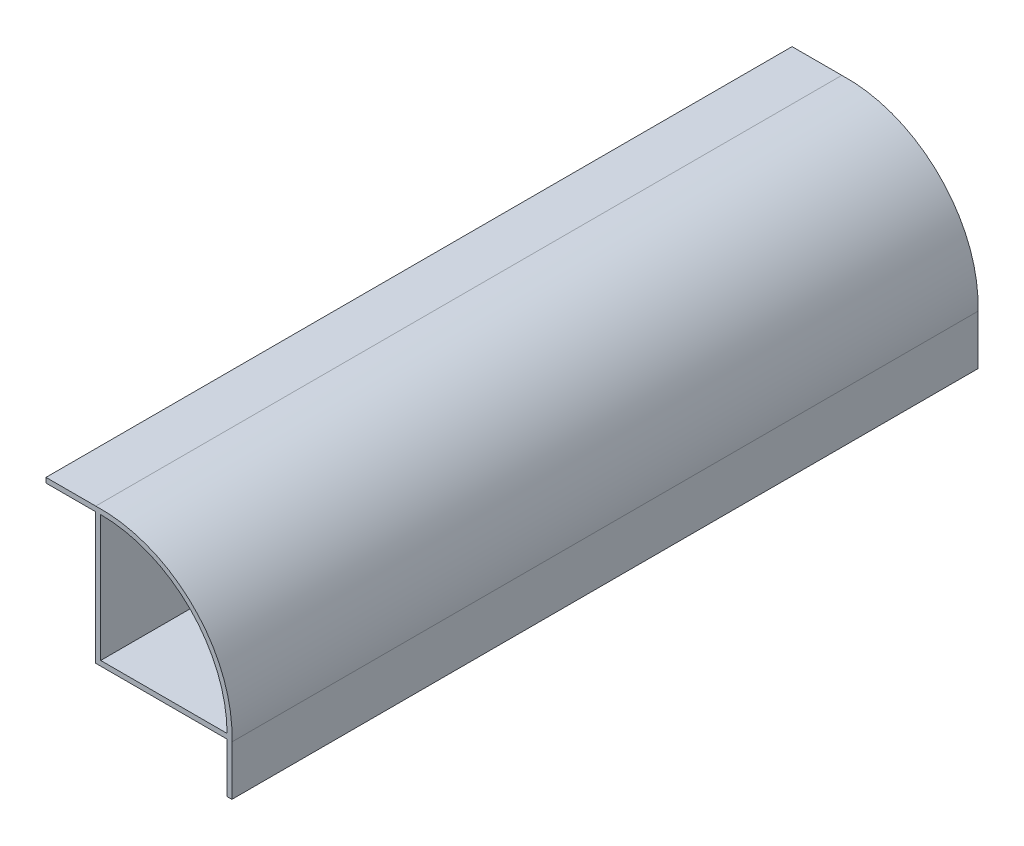
ISO-10303-21;
HEADER;
FILE_DESCRIPTION(('STEP AP214'),'2;1');
FILE_NAME('part.step','',(''),(''),'','','');
FILE_SCHEMA(('AUTOMOTIVE_DESIGN { 1 0 10303 214 1 1 1 1 }'));
ENDSEC;
DATA;
#1=APPLICATION_CONTEXT('core data for automotive mechanical design processes');
#2=APPLICATION_PROTOCOL_DEFINITION('international standard','automotive_design',2000,#1);
#3=PRODUCT_CONTEXT('',#1,'mechanical');
#4=PRODUCT('Part','Part','',(#3));
#5=PRODUCT_RELATED_PRODUCT_CATEGORY('part','',(#4));
#6=PRODUCT_DEFINITION_FORMATION('','',#4);
#7=PRODUCT_DEFINITION_CONTEXT('part definition',#1,'design');
#8=PRODUCT_DEFINITION('design','',#6,#7);
#9=PRODUCT_DEFINITION_SHAPE('','',#8);
#10=(LENGTH_UNIT() NAMED_UNIT(*) SI_UNIT(.MILLI.,.METRE.));
#11=(NAMED_UNIT(*) PLANE_ANGLE_UNIT() SI_UNIT($,.RADIAN.));
#12=(NAMED_UNIT(*) SI_UNIT($,.STERADIAN.) SOLID_ANGLE_UNIT());
#13=UNCERTAINTY_MEASURE_WITH_UNIT(LENGTH_MEASURE(1.E-05),#10,'distance_accuracy_value','');
#14=(GEOMETRIC_REPRESENTATION_CONTEXT(3) GLOBAL_UNCERTAINTY_ASSIGNED_CONTEXT((#13)) GLOBAL_UNIT_ASSIGNED_CONTEXT((#10,
#11,#12)) REPRESENTATION_CONTEXT('',''));
#15=CARTESIAN_POINT('',(0.,0.,0.));
#16=DIRECTION('',(0.,0.,1.));
#17=DIRECTION('',(1.,0.,0.));
#18=AXIS2_PLACEMENT_3D('',#15,#16,#17);
#19=CARTESIAN_POINT('',(-12.7,0.,75.));
#20=DIRECTION('',(-1.,0.,0.));
#21=DIRECTION('',(0.,-1.,0.));
#22=AXIS2_PLACEMENT_3D('',#19,#20,#21);
#23=PLANE('',#22);
#24=DIRECTION('',(0.,1.,0.));
#25=VECTOR('',#24,1.);
#26=CARTESIAN_POINT('',(-12.7,0.,-75.));
#27=LINE('',#26,#25);
#28=CARTESIAN_POINT('',(-12.7,-12.7,-75.));
#29=VERTEX_POINT('',#28);
#30=CARTESIAN_POINT('',(-12.7,12.7,-75.));
#31=VERTEX_POINT('',#30);
#32=EDGE_CURVE('E143',#29,#31,#27,.T.);
#33=ORIENTED_EDGE('',*,*,#32,.T.);
#34=DIRECTION('',(0.,0.,-1.));
#35=VECTOR('',#34,1.);
#36=CARTESIAN_POINT('',(-12.7,12.7,75.));
#37=LINE('',#36,#35);
#38=CARTESIAN_POINT('',(-12.7,12.7,75.));
#39=VERTEX_POINT('',#38);
#40=EDGE_CURVE('E11',#39,#31,#37,.T.);
#41=ORIENTED_EDGE('',*,*,#40,.F.);
#42=DIRECTION('',(0.,1.,0.));
#43=VECTOR('',#42,1.);
#44=CARTESIAN_POINT('',(-12.7,0.,75.));
#45=LINE('',#44,#43);
#46=CARTESIAN_POINT('',(-12.7,-12.7,75.));
#47=VERTEX_POINT('',#46);
#48=EDGE_CURVE('E138',#47,#39,#45,.T.);
#49=ORIENTED_EDGE('',*,*,#48,.F.);
#50=DIRECTION('',(0.,0.,-1.));
#51=VECTOR('',#50,1.);
#52=CARTESIAN_POINT('',(-12.7,-12.7,75.));
#53=LINE('',#52,#51);
#54=EDGE_CURVE('E55',#47,#29,#53,.T.);
#55=ORIENTED_EDGE('',*,*,#54,.T.);
#56=EDGE_LOOP('',(#33,#41,#49,#55));
#57=FACE_BOUND('',#56,.T.);
#58=ADVANCED_FACE('F36',(#57),#23,.F.);
#59=CARTESIAN_POINT('',(-12.7,-12.7,75.));
#60=DIRECTION('',(0.,0.,-1.));
#61=DIRECTION('',(-1.,0.,0.));
#62=AXIS2_PLACEMENT_3D('',#59,#60,#61);
#63=CYLINDRICAL_SURFACE('',#62,25.4);
#64=CARTESIAN_POINT('',(-12.7,-12.7,-75.));
#65=DIRECTION('',(0.,0.,1.));
#66=DIRECTION('',(1.,0.,0.));
#67=AXIS2_PLACEMENT_3D('',#64,#65,#66);
#68=CIRCLE('',#67,25.4);
#69=CARTESIAN_POINT('',(12.7,-12.7,-75.));
#70=VERTEX_POINT('',#69);
#71=EDGE_CURVE('E146',#31,#70,#68,.F.);
#72=ORIENTED_EDGE('',*,*,#71,.T.);
#73=DIRECTION('',(0.,0.,-1.));
#74=VECTOR('',#73,1.);
#75=CARTESIAN_POINT('',(12.7,-12.7,75.));
#76=LINE('',#75,#74);
#77=CARTESIAN_POINT('',(12.7,-12.7,75.));
#78=VERTEX_POINT('',#77);
#79=EDGE_CURVE('E46',#78,#70,#76,.T.);
#80=ORIENTED_EDGE('',*,*,#79,.F.);
#81=CARTESIAN_POINT('',(-12.7,-12.7,75.));
#82=DIRECTION('',(0.,0.,1.));
#83=DIRECTION('',(1.,0.,0.));
#84=AXIS2_PLACEMENT_3D('',#81,#82,#83);
#85=CIRCLE('',#84,25.4);
#86=EDGE_CURVE('E131',#39,#78,#85,.F.);
#87=ORIENTED_EDGE('',*,*,#86,.F.);
#88=ORIENTED_EDGE('',*,*,#40,.T.);
#89=EDGE_LOOP('',(#72,#80,#87,#88));
#90=FACE_BOUND('',#89,.T.);
#91=ADVANCED_FACE('F133',(#90),#63,.F.);
#92=CARTESIAN_POINT('',(-12.7,-12.7,75.));
#93=DIRECTION('',(0.,0.,-1.));
#94=DIRECTION('',(-1.,0.,0.));
#95=AXIS2_PLACEMENT_3D('',#92,#93,#94);
#96=CYLINDRICAL_SURFACE('',#95,26.4);
#97=CARTESIAN_POINT('',(-12.7,-12.7,-75.));
#98=DIRECTION('',(0.,0.,1.));
#99=DIRECTION('',(1.,0.,0.));
#100=AXIS2_PLACEMENT_3D('',#97,#98,#99);
#101=CIRCLE('',#100,26.4);
#102=CARTESIAN_POINT('',(-13.7,13.6810538076097,-75.));
#103=VERTEX_POINT('',#102);
#104=CARTESIAN_POINT('',(13.6810538076097,-13.7,-75.));
#105=VERTEX_POINT('',#104);
#106=EDGE_CURVE('E190',#103,#105,#101,.F.);
#107=ORIENTED_EDGE('',*,*,#106,.F.);
#108=DIRECTION('',(0.,0.,-1.));
#109=VECTOR('',#108,1.);
#110=CARTESIAN_POINT('',(-13.7,13.6810538076097,75.));
#111=LINE('',#110,#109);
#112=CARTESIAN_POINT('',(-13.7,13.6810538076097,75.));
#113=VERTEX_POINT('',#112);
#114=EDGE_CURVE('E40',#113,#103,#111,.T.);
#115=ORIENTED_EDGE('',*,*,#114,.F.);
#116=CARTESIAN_POINT('',(-12.7,-12.7,75.));
#117=DIRECTION('',(0.,0.,1.));
#118=DIRECTION('',(1.,0.,0.));
#119=AXIS2_PLACEMENT_3D('',#116,#117,#118);
#120=CIRCLE('',#119,26.4);
#121=CARTESIAN_POINT('',(13.6810538076097,-13.7,75.));
#122=VERTEX_POINT('',#121);
#123=EDGE_CURVE('E157',#113,#122,#120,.F.);
#124=ORIENTED_EDGE('',*,*,#123,.T.);
#125=DIRECTION('',(0.,0.,-1.));
#126=VECTOR('',#125,1.);
#127=CARTESIAN_POINT('',(13.6810538076097,-13.7,75.));
#128=LINE('',#127,#126);
#129=EDGE_CURVE('E160',#122,#105,#128,.T.);
#130=ORIENTED_EDGE('',*,*,#129,.T.);
#131=EDGE_LOOP('',(#107,#115,#124,#130));
#132=FACE_BOUND('',#131,.T.);
#133=ADVANCED_FACE('F38',(#132),#96,.T.);
#134=CARTESIAN_POINT('',(0.,13.6810538076097,75.));
#135=DIRECTION('',(0.,-1.,0.));
#136=DIRECTION('',(1.,0.,0.));
#137=AXIS2_PLACEMENT_3D('',#134,#135,#136);
#138=PLANE('',#137);
#139=DIRECTION('',(-1.,0.,0.));
#140=VECTOR('',#139,1.);
#141=CARTESIAN_POINT('',(0.,13.6810538076097,-75.));
#142=LINE('',#141,#140);
#143=CARTESIAN_POINT('',(-23.7,13.6810538076097,-75.));
#144=VERTEX_POINT('',#143);
#145=EDGE_CURVE('E184',#103,#144,#142,.T.);
#146=ORIENTED_EDGE('',*,*,#145,.T.);
#147=DIRECTION('',(0.,0.,-1.));
#148=VECTOR('',#147,1.);
#149=CARTESIAN_POINT('',(-23.7,13.6810538076097,75.));
#150=LINE('',#149,#148);
#151=CARTESIAN_POINT('',(-23.7,13.6810538076097,75.));
#152=VERTEX_POINT('',#151);
#153=EDGE_CURVE('E174',#152,#144,#150,.T.);
#154=ORIENTED_EDGE('',*,*,#153,.F.);
#155=DIRECTION('',(-1.,0.,0.));
#156=VECTOR('',#155,1.);
#157=CARTESIAN_POINT('',(0.,13.6810538076097,75.));
#158=LINE('',#157,#156);
#159=EDGE_CURVE('E185',#113,#152,#158,.T.);
#160=ORIENTED_EDGE('',*,*,#159,.F.);
#161=ORIENTED_EDGE('',*,*,#114,.T.);
#162=EDGE_LOOP('',(#146,#154,#160,#161));
#163=FACE_BOUND('',#162,.T.);
#164=ADVANCED_FACE('F183',(#163),#138,.F.);
#165=CARTESIAN_POINT('',(-23.7,0.,75.));
#166=DIRECTION('',(1.,0.,0.));
#167=DIRECTION('',(0.,0.,-1.));
#168=AXIS2_PLACEMENT_3D('',#165,#166,#167);
#169=PLANE('',#168);
#170=DIRECTION('',(0.,-1.,0.));
#171=VECTOR('',#170,1.);
#172=CARTESIAN_POINT('',(-23.7,0.,-75.));
#173=LINE('',#172,#171);
#174=CARTESIAN_POINT('',(-23.7,12.6810538076097,-75.));
#175=VERTEX_POINT('',#174);
#176=EDGE_CURVE('E193',#144,#175,#173,.T.);
#177=ORIENTED_EDGE('',*,*,#176,.T.);
#178=DIRECTION('',(0.,0.,-1.));
#179=VECTOR('',#178,1.);
#180=CARTESIAN_POINT('',(-23.7,12.6810538076097,75.));
#181=LINE('',#180,#179);
#182=CARTESIAN_POINT('',(-23.7,12.6810538076097,75.));
#183=VERTEX_POINT('',#182);
#184=EDGE_CURVE('E173',#183,#175,#181,.T.);
#185=ORIENTED_EDGE('',*,*,#184,.F.);
#186=DIRECTION('',(0.,-1.,0.));
#187=VECTOR('',#186,1.);
#188=CARTESIAN_POINT('',(-23.7,0.,75.));
#189=LINE('',#188,#187);
#190=EDGE_CURVE('E376',#152,#183,#189,.T.);
#191=ORIENTED_EDGE('',*,*,#190,.F.);
#192=ORIENTED_EDGE('',*,*,#153,.T.);
#193=EDGE_LOOP('',(#177,#185,#191,#192));
#194=FACE_BOUND('',#193,.T.);
#195=ADVANCED_FACE('F240',(#194),#169,.F.);
#196=CARTESIAN_POINT('',(0.,12.6810538076097,75.));
#197=DIRECTION('',(0.,-1.,0.));
#198=DIRECTION('',(1.,0.,0.));
#199=AXIS2_PLACEMENT_3D('',#196,#197,#198);
#200=PLANE('',#199);
#201=DIRECTION('',(-1.,0.,0.));
#202=VECTOR('',#201,1.);
#203=CARTESIAN_POINT('',(0.,12.6810538076097,-75.));
#204=LINE('',#203,#202);
#205=CARTESIAN_POINT('',(-13.7,12.6810538076097,-75.));
#206=VERTEX_POINT('',#205);
#207=EDGE_CURVE('E199',#206,#175,#204,.T.);
#208=ORIENTED_EDGE('',*,*,#207,.F.);
#209=DIRECTION('',(0.,0.,-1.));
#210=VECTOR('',#209,1.);
#211=CARTESIAN_POINT('',(-13.7,12.6810538076097,75.));
#212=LINE('',#211,#210);
#213=CARTESIAN_POINT('',(-13.7,12.6810538076097,75.));
#214=VERTEX_POINT('',#213);
#215=EDGE_CURVE('E171',#214,#206,#212,.T.);
#216=ORIENTED_EDGE('',*,*,#215,.F.);
#217=DIRECTION('',(-1.,0.,0.));
#218=VECTOR('',#217,1.);
#219=CARTESIAN_POINT('',(0.,12.6810538076097,75.));
#220=LINE('',#219,#218);
#221=EDGE_CURVE('E239',#214,#183,#220,.T.);
#222=ORIENTED_EDGE('',*,*,#221,.T.);
#223=ORIENTED_EDGE('',*,*,#184,.T.);
#224=EDGE_LOOP('',(#208,#216,#222,#223));
#225=FACE_BOUND('',#224,.T.);
#226=ADVANCED_FACE('F237',(#225),#200,.T.);
#227=CARTESIAN_POINT('',(-13.7,0.,75.));
#228=DIRECTION('',(-1.,0.,0.));
#229=DIRECTION('',(0.,-1.,0.));
#230=AXIS2_PLACEMENT_3D('',#227,#228,#229);
#231=PLANE('',#230);
#232=DIRECTION('',(0.,1.,0.));
#233=VECTOR('',#232,1.);
#234=CARTESIAN_POINT('',(-13.7,0.,-75.));
#235=LINE('',#234,#233);
#236=CARTESIAN_POINT('',(-13.7,-13.7,-75.));
#237=VERTEX_POINT('',#236);
#238=EDGE_CURVE('E201',#237,#206,#235,.T.);
#239=ORIENTED_EDGE('',*,*,#238,.F.);
#240=DIRECTION('',(0.,0.,-1.));
#241=VECTOR('',#240,1.);
#242=CARTESIAN_POINT('',(-13.7,-13.7,75.));
#243=LINE('',#242,#241);
#244=CARTESIAN_POINT('',(-13.7,-13.7,75.));
#245=VERTEX_POINT('',#244);
#246=EDGE_CURVE('E169',#245,#237,#243,.T.);
#247=ORIENTED_EDGE('',*,*,#246,.F.);
#248=DIRECTION('',(0.,1.,0.));
#249=VECTOR('',#248,1.);
#250=CARTESIAN_POINT('',(-13.7,0.,75.));
#251=LINE('',#250,#249);
#252=EDGE_CURVE('E233',#245,#214,#251,.T.);
#253=ORIENTED_EDGE('',*,*,#252,.T.);
#254=ORIENTED_EDGE('',*,*,#215,.T.);
#255=EDGE_LOOP('',(#239,#247,#253,#254));
#256=FACE_BOUND('',#255,.T.);
#257=ADVANCED_FACE('F230',(#256),#231,.T.);
#258=CARTESIAN_POINT('',(0.,-13.7,75.));
#259=DIRECTION('',(0.,1.,0.));
#260=DIRECTION('',(0.,0.,1.));
#261=AXIS2_PLACEMENT_3D('',#258,#259,#260);
#262=PLANE('',#261);
#263=DIRECTION('',(1.,0.,0.));
#264=VECTOR('',#263,1.);
#265=CARTESIAN_POINT('',(0.,-13.7,-75.));
#266=LINE('',#265,#264);
#267=CARTESIAN_POINT('',(12.6810538076097,-13.7,-75.));
#268=VERTEX_POINT('',#267);
#269=EDGE_CURVE('E204',#237,#268,#266,.T.);
#270=ORIENTED_EDGE('',*,*,#269,.T.);
#271=DIRECTION('',(0.,0.,-1.));
#272=VECTOR('',#271,1.);
#273=CARTESIAN_POINT('',(12.6810538076097,-13.7,75.));
#274=LINE('',#273,#272);
#275=CARTESIAN_POINT('',(12.6810538076097,-13.7,75.));
#276=VERTEX_POINT('',#275);
#277=EDGE_CURVE('E166',#276,#268,#274,.T.);
#278=ORIENTED_EDGE('',*,*,#277,.F.);
#279=DIRECTION('',(1.,0.,0.));
#280=VECTOR('',#279,1.);
#281=CARTESIAN_POINT('',(0.,-13.7,75.));
#282=LINE('',#281,#280);
#283=EDGE_CURVE('E226',#245,#276,#282,.T.);
#284=ORIENTED_EDGE('',*,*,#283,.F.);
#285=ORIENTED_EDGE('',*,*,#246,.T.);
#286=EDGE_LOOP('',(#270,#278,#284,#285));
#287=FACE_BOUND('',#286,.T.);
#288=ADVANCED_FACE('F225',(#287),#262,.F.);
#289=CARTESIAN_POINT('',(12.6810538076097,0.,75.));
#290=DIRECTION('',(1.,0.,0.));
#291=DIRECTION('',(0.,1.,0.));
#292=AXIS2_PLACEMENT_3D('',#289,#290,#291);
#293=PLANE('',#292);
#294=DIRECTION('',(0.,-1.,0.));
#295=VECTOR('',#294,1.);
#296=CARTESIAN_POINT('',(12.6810538076097,0.,-75.));
#297=LINE('',#296,#295);
#298=CARTESIAN_POINT('',(12.6810538076097,-23.7,-75.));
#299=VERTEX_POINT('',#298);
#300=EDGE_CURVE('E206',#268,#299,#297,.T.);
#301=ORIENTED_EDGE('',*,*,#300,.T.);
#302=DIRECTION('',(0.,0.,-1.));
#303=VECTOR('',#302,1.);
#304=CARTESIAN_POINT('',(12.6810538076097,-23.7,75.));
#305=LINE('',#304,#303);
#306=CARTESIAN_POINT('',(12.6810538076097,-23.7,75.));
#307=VERTEX_POINT('',#306);
#308=EDGE_CURVE('E164',#307,#299,#305,.T.);
#309=ORIENTED_EDGE('',*,*,#308,.F.);
#310=DIRECTION('',(0.,-1.,0.));
#311=VECTOR('',#310,1.);
#312=CARTESIAN_POINT('',(12.6810538076097,0.,75.));
#313=LINE('',#312,#311);
#314=EDGE_CURVE('E222',#276,#307,#313,.T.);
#315=ORIENTED_EDGE('',*,*,#314,.F.);
#316=ORIENTED_EDGE('',*,*,#277,.T.);
#317=EDGE_LOOP('',(#301,#309,#315,#316));
#318=FACE_BOUND('',#317,.T.);
#319=ADVANCED_FACE('F220',(#318),#293,.F.);
#320=CARTESIAN_POINT('',(0.,-23.7,75.));
#321=DIRECTION('',(0.,-1.,0.));
#322=DIRECTION('',(0.,0.,-1.));
#323=AXIS2_PLACEMENT_3D('',#320,#321,#322);
#324=PLANE('',#323);
#325=DIRECTION('',(-1.,0.,0.));
#326=VECTOR('',#325,1.);
#327=CARTESIAN_POINT('',(0.,-23.7,-75.));
#328=LINE('',#327,#326);
#329=CARTESIAN_POINT('',(13.6810538076097,-23.7,-75.));
#330=VERTEX_POINT('',#329);
#331=EDGE_CURVE('E152',#330,#299,#328,.T.);
#332=ORIENTED_EDGE('',*,*,#331,.F.);
#333=DIRECTION('',(0.,0.,-1.));
#334=VECTOR('',#333,1.);
#335=CARTESIAN_POINT('',(13.6810538076097,-23.7,75.));
#336=LINE('',#335,#334);
#337=CARTESIAN_POINT('',(13.6810538076097,-23.7,75.));
#338=VERTEX_POINT('',#337);
#339=EDGE_CURVE('E162',#338,#330,#336,.T.);
#340=ORIENTED_EDGE('',*,*,#339,.F.);
#341=DIRECTION('',(-1.,0.,0.));
#342=VECTOR('',#341,1.);
#343=CARTESIAN_POINT('',(0.,-23.7,75.));
#344=LINE('',#343,#342);
#345=EDGE_CURVE('E217',#338,#307,#344,.T.);
#346=ORIENTED_EDGE('',*,*,#345,.T.);
#347=ORIENTED_EDGE('',*,*,#308,.T.);
#348=EDGE_LOOP('',(#332,#340,#346,#347));
#349=FACE_BOUND('',#348,.T.);
#350=ADVANCED_FACE('F213',(#349),#324,.T.);
#351=CARTESIAN_POINT('',(13.6810538076097,0.,75.));
#352=DIRECTION('',(1.,0.,0.));
#353=DIRECTION('',(0.,1.,0.));
#354=AXIS2_PLACEMENT_3D('',#351,#352,#353);
#355=PLANE('',#354);
#356=DIRECTION('',(0.,-1.,0.));
#357=VECTOR('',#356,1.);
#358=CARTESIAN_POINT('',(13.6810538076097,0.,-75.));
#359=LINE('',#358,#357);
#360=EDGE_CURVE('E147',#105,#330,#359,.T.);
#361=ORIENTED_EDGE('',*,*,#360,.F.);
#362=ORIENTED_EDGE('',*,*,#129,.F.);
#363=DIRECTION('',(0.,-1.,0.));
#364=VECTOR('',#363,1.);
#365=CARTESIAN_POINT('',(13.6810538076097,0.,75.));
#366=LINE('',#365,#364);
#367=EDGE_CURVE('E141',#122,#338,#366,.T.);
#368=ORIENTED_EDGE('',*,*,#367,.T.);
#369=ORIENTED_EDGE('',*,*,#339,.T.);
#370=EDGE_LOOP('',(#361,#362,#368,#369));
#371=FACE_BOUND('',#370,.T.);
#372=ADVANCED_FACE('F256',(#371),#355,.T.);
#373=CARTESIAN_POINT('',(0.,-12.7,75.));
#374=DIRECTION('',(0.,1.,0.));
#375=DIRECTION('',(-1.,0.,0.));
#376=AXIS2_PLACEMENT_3D('',#373,#374,#375);
#377=PLANE('',#376);
#378=DIRECTION('',(1.,0.,0.));
#379=VECTOR('',#378,1.);
#380=CARTESIAN_POINT('',(0.,-12.7,-75.));
#381=LINE('',#380,#379);
#382=EDGE_CURVE('E149',#29,#70,#381,.T.);
#383=ORIENTED_EDGE('',*,*,#382,.F.);
#384=ORIENTED_EDGE('',*,*,#54,.F.);
#385=DIRECTION('',(1.,0.,0.));
#386=VECTOR('',#385,1.);
#387=CARTESIAN_POINT('',(0.,-12.7,75.));
#388=LINE('',#387,#386);
#389=EDGE_CURVE('E137',#47,#78,#388,.T.);
#390=ORIENTED_EDGE('',*,*,#389,.T.);
#391=ORIENTED_EDGE('',*,*,#79,.T.);
#392=EDGE_LOOP('',(#383,#384,#390,#391));
#393=FACE_BOUND('',#392,.T.);
#394=ADVANCED_FACE('F259',(#393),#377,.T.);
#395=CARTESIAN_POINT('',(0.,0.,75.));
#396=DIRECTION('',(0.,0.,1.));
#397=DIRECTION('',(1.,0.,0.));
#398=AXIS2_PLACEMENT_3D('',#395,#396,#397);
#399=PLANE('',#398);
#400=ORIENTED_EDGE('',*,*,#123,.F.);
#401=ORIENTED_EDGE('',*,*,#159,.T.);
#402=ORIENTED_EDGE('',*,*,#190,.T.);
#403=ORIENTED_EDGE('',*,*,#221,.F.);
#404=ORIENTED_EDGE('',*,*,#252,.F.);
#405=ORIENTED_EDGE('',*,*,#283,.T.);
#406=ORIENTED_EDGE('',*,*,#314,.T.);
#407=ORIENTED_EDGE('',*,*,#345,.F.);
#408=ORIENTED_EDGE('',*,*,#367,.F.);
#409=EDGE_LOOP('',(#400,#401,#402,#403,#404,#405,#406,#407,#408));
#410=FACE_BOUND('',#409,.T.);
#411=ORIENTED_EDGE('',*,*,#48,.T.);
#412=ORIENTED_EDGE('',*,*,#86,.T.);
#413=ORIENTED_EDGE('',*,*,#389,.F.);
#414=EDGE_LOOP('',(#411,#412,#413));
#415=FACE_BOUND('',#414,.T.);
#416=ADVANCED_FACE('F140',(#410,#415),#399,.T.);
#417=CARTESIAN_POINT('',(0.,0.,-75.));
#418=DIRECTION('',(0.,0.,1.));
#419=DIRECTION('',(1.,0.,0.));
#420=AXIS2_PLACEMENT_3D('',#417,#418,#419);
#421=PLANE('',#420);
#422=ORIENTED_EDGE('',*,*,#106,.T.);
#423=ORIENTED_EDGE('',*,*,#360,.T.);
#424=ORIENTED_EDGE('',*,*,#331,.T.);
#425=ORIENTED_EDGE('',*,*,#300,.F.);
#426=ORIENTED_EDGE('',*,*,#269,.F.);
#427=ORIENTED_EDGE('',*,*,#238,.T.);
#428=ORIENTED_EDGE('',*,*,#207,.T.);
#429=ORIENTED_EDGE('',*,*,#176,.F.);
#430=ORIENTED_EDGE('',*,*,#145,.F.);
#431=EDGE_LOOP('',(#422,#423,#424,#425,#426,#427,#428,#429,#430));
#432=FACE_BOUND('',#431,.T.);
#433=ORIENTED_EDGE('',*,*,#32,.F.);
#434=ORIENTED_EDGE('',*,*,#382,.T.);
#435=ORIENTED_EDGE('',*,*,#71,.F.);
#436=EDGE_LOOP('',(#433,#434,#435));
#437=FACE_BOUND('',#436,.T.);
#438=ADVANCED_FACE('F189',(#432,#437),#421,.F.);
#439=CLOSED_SHELL('',(#58,#91,#133,#164,#195,#226,#257,#288,#319,#350,#372,#394,#416,#438));
#440=MANIFOLD_SOLID_BREP('B2',#439);
#441=ADVANCED_BREP_SHAPE_REPRESENTATION('',(#18,#440),#14);
#442=SHAPE_DEFINITION_REPRESENTATION(#9,#441);
ENDSEC;
END-ISO-10303-21;
